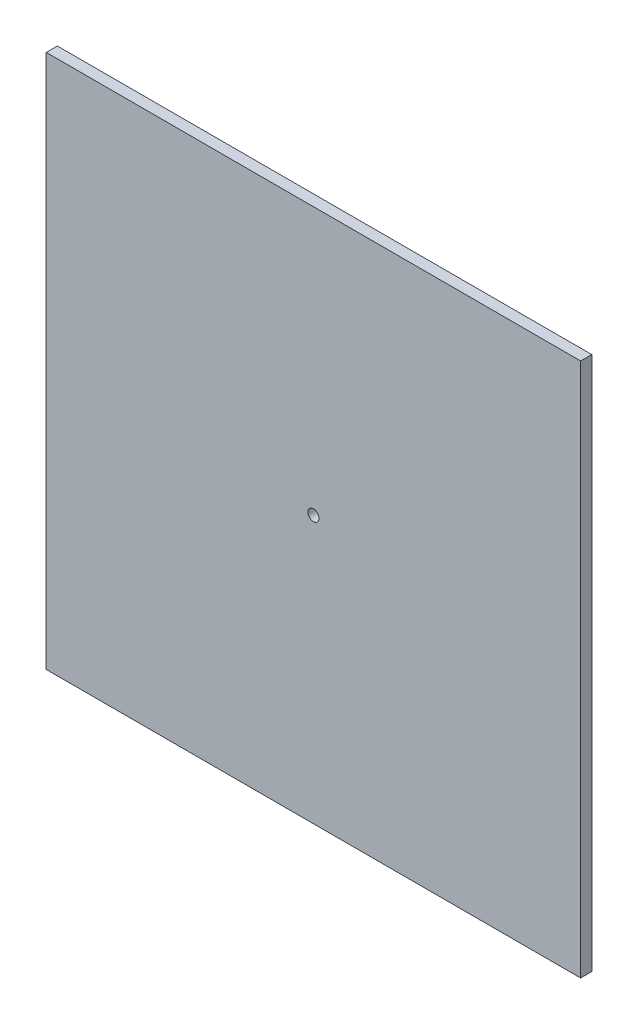
ISO-10303-21;
HEADER;
FILE_DESCRIPTION(('STEP AP214'),'2;1');
FILE_NAME('part.step','',(''),(''),'','','');
FILE_SCHEMA(('AUTOMOTIVE_DESIGN { 1 0 10303 214 1 1 1 1 }'));
ENDSEC;
DATA;
#1=APPLICATION_CONTEXT('core data for automotive mechanical design processes');
#2=APPLICATION_PROTOCOL_DEFINITION('international standard','automotive_design',2000,#1);
#3=PRODUCT_CONTEXT('',#1,'mechanical');
#4=PRODUCT('Part','Part','',(#3));
#5=PRODUCT_RELATED_PRODUCT_CATEGORY('part','',(#4));
#6=PRODUCT_DEFINITION_FORMATION('','',#4);
#7=PRODUCT_DEFINITION_CONTEXT('part definition',#1,'design');
#8=PRODUCT_DEFINITION('design','',#6,#7);
#9=PRODUCT_DEFINITION_SHAPE('','',#8);
#10=(LENGTH_UNIT() NAMED_UNIT(*) SI_UNIT(.MILLI.,.METRE.));
#11=(NAMED_UNIT(*) PLANE_ANGLE_UNIT() SI_UNIT($,.RADIAN.));
#12=(NAMED_UNIT(*) SI_UNIT($,.STERADIAN.) SOLID_ANGLE_UNIT());
#13=UNCERTAINTY_MEASURE_WITH_UNIT(LENGTH_MEASURE(1.E-05),#10,'distance_accuracy_value','');
#14=(GEOMETRIC_REPRESENTATION_CONTEXT(3) GLOBAL_UNCERTAINTY_ASSIGNED_CONTEXT((#13)) GLOBAL_UNIT_ASSIGNED_CONTEXT((#10,
#11,#12)) REPRESENTATION_CONTEXT('',''));
#15=CARTESIAN_POINT('',(0.,0.,0.));
#16=DIRECTION('',(0.,0.,1.));
#17=DIRECTION('',(1.,0.,0.));
#18=AXIS2_PLACEMENT_3D('',#15,#16,#17);
#19=CARTESIAN_POINT('',(0.,0.,6.35));
#20=DIRECTION('',(-1.,0.,0.));
#21=DIRECTION('',(0.,-1.,0.));
#22=AXIS2_PLACEMENT_3D('',#19,#20,#21);
#23=PLANE('',#22);
#24=DIRECTION('',(0.,1.,0.));
#25=VECTOR('',#24,1.);
#26=CARTESIAN_POINT('',(0.,0.,0.));
#27=LINE('',#26,#25);
#28=CARTESIAN_POINT('',(0.,0.,0.));
#29=VERTEX_POINT('',#28);
#30=CARTESIAN_POINT('',(0.,304.8,0.));
#31=VERTEX_POINT('',#30);
#32=EDGE_CURVE('E99',#29,#31,#27,.T.);
#33=ORIENTED_EDGE('',*,*,#32,.T.);
#34=DIRECTION('',(0.,0.,-1.));
#35=VECTOR('',#34,1.);
#36=CARTESIAN_POINT('',(0.,304.8,6.35));
#37=LINE('',#36,#35);
#38=CARTESIAN_POINT('',(0.,304.8,6.35));
#39=VERTEX_POINT('',#38);
#40=EDGE_CURVE('E11',#39,#31,#37,.T.);
#41=ORIENTED_EDGE('',*,*,#40,.F.);
#42=DIRECTION('',(0.,1.,0.));
#43=VECTOR('',#42,1.);
#44=CARTESIAN_POINT('',(0.,0.,6.35));
#45=LINE('',#44,#43);
#46=CARTESIAN_POINT('',(0.,0.,6.35));
#47=VERTEX_POINT('',#46);
#48=EDGE_CURVE('E87',#47,#39,#45,.T.);
#49=ORIENTED_EDGE('',*,*,#48,.F.);
#50=DIRECTION('',(0.,0.,-1.));
#51=VECTOR('',#50,1.);
#52=CARTESIAN_POINT('',(0.,0.,6.35));
#53=LINE('',#52,#51);
#54=EDGE_CURVE('E95',#47,#29,#53,.T.);
#55=ORIENTED_EDGE('',*,*,#54,.T.);
#56=EDGE_LOOP('',(#33,#41,#49,#55));
#57=FACE_BOUND('',#56,.T.);
#58=ADVANCED_FACE('F36',(#57),#23,.F.);
#59=CARTESIAN_POINT('',(0.,304.8,6.35));
#60=DIRECTION('',(0.,-1.,0.));
#61=DIRECTION('',(1.,0.,0.));
#62=AXIS2_PLACEMENT_3D('',#59,#60,#61);
#63=PLANE('',#62);
#64=DIRECTION('',(-1.,0.,0.));
#65=VECTOR('',#64,1.);
#66=CARTESIAN_POINT('',(0.,304.8,0.));
#67=LINE('',#66,#65);
#68=CARTESIAN_POINT('',(-304.8,304.8,0.));
#69=VERTEX_POINT('',#68);
#70=EDGE_CURVE('E91',#31,#69,#67,.T.);
#71=ORIENTED_EDGE('',*,*,#70,.T.);
#72=DIRECTION('',(0.,0.,-1.));
#73=VECTOR('',#72,1.);
#74=CARTESIAN_POINT('',(-304.8,304.8,6.35));
#75=LINE('',#74,#73);
#76=CARTESIAN_POINT('',(-304.8,304.8,6.35));
#77=VERTEX_POINT('',#76);
#78=EDGE_CURVE('E44',#77,#69,#75,.T.);
#79=ORIENTED_EDGE('',*,*,#78,.F.);
#80=DIRECTION('',(-1.,0.,0.));
#81=VECTOR('',#80,1.);
#82=CARTESIAN_POINT('',(0.,304.8,6.35));
#83=LINE('',#82,#81);
#84=EDGE_CURVE('E82',#39,#77,#83,.T.);
#85=ORIENTED_EDGE('',*,*,#84,.F.);
#86=ORIENTED_EDGE('',*,*,#40,.T.);
#87=EDGE_LOOP('',(#71,#79,#85,#86));
#88=FACE_BOUND('',#87,.T.);
#89=ADVANCED_FACE('F90',(#88),#63,.F.);
#90=CARTESIAN_POINT('',(-304.8,0.,6.35));
#91=DIRECTION('',(1.,0.,0.));
#92=DIRECTION('',(0.,0.,-1.));
#93=AXIS2_PLACEMENT_3D('',#90,#91,#92);
#94=PLANE('',#93);
#95=DIRECTION('',(0.,-1.,0.));
#96=VECTOR('',#95,1.);
#97=CARTESIAN_POINT('',(-304.8,0.,0.));
#98=LINE('',#97,#96);
#99=CARTESIAN_POINT('',(-304.8,0.,0.));
#100=VERTEX_POINT('',#99);
#101=EDGE_CURVE('E69',#69,#100,#98,.T.);
#102=ORIENTED_EDGE('',*,*,#101,.T.);
#103=DIRECTION('',(0.,0.,-1.));
#104=VECTOR('',#103,1.);
#105=CARTESIAN_POINT('',(-304.8,0.,6.35));
#106=LINE('',#105,#104);
#107=CARTESIAN_POINT('',(-304.8,0.,6.35));
#108=VERTEX_POINT('',#107);
#109=EDGE_CURVE('E92',#108,#100,#106,.T.);
#110=ORIENTED_EDGE('',*,*,#109,.F.);
#111=DIRECTION('',(0.,-1.,0.));
#112=VECTOR('',#111,1.);
#113=CARTESIAN_POINT('',(-304.8,0.,6.35));
#114=LINE('',#113,#112);
#115=EDGE_CURVE('E85',#77,#108,#114,.T.);
#116=ORIENTED_EDGE('',*,*,#115,.F.);
#117=ORIENTED_EDGE('',*,*,#78,.T.);
#118=EDGE_LOOP('',(#102,#110,#116,#117));
#119=FACE_BOUND('',#118,.T.);
#120=ADVANCED_FACE('F93',(#119),#94,.F.);
#121=CARTESIAN_POINT('',(0.,0.,6.35));
#122=DIRECTION('',(0.,1.,0.));
#123=DIRECTION('',(0.,0.,1.));
#124=AXIS2_PLACEMENT_3D('',#121,#122,#123);
#125=PLANE('',#124);
#126=DIRECTION('',(1.,0.,0.));
#127=VECTOR('',#126,1.);
#128=CARTESIAN_POINT('',(0.,0.,0.));
#129=LINE('',#128,#127);
#130=EDGE_CURVE('E75',#100,#29,#129,.T.);
#131=ORIENTED_EDGE('',*,*,#130,.T.);
#132=ORIENTED_EDGE('',*,*,#54,.F.);
#133=DIRECTION('',(1.,0.,0.));
#134=VECTOR('',#133,1.);
#135=CARTESIAN_POINT('',(0.,0.,6.35));
#136=LINE('',#135,#134);
#137=EDGE_CURVE('E52',#108,#47,#136,.T.);
#138=ORIENTED_EDGE('',*,*,#137,.F.);
#139=ORIENTED_EDGE('',*,*,#109,.T.);
#140=EDGE_LOOP('',(#131,#132,#138,#139));
#141=FACE_BOUND('',#140,.T.);
#142=ADVANCED_FACE('F107',(#141),#125,.F.);
#143=CARTESIAN_POINT('',(0.,0.,6.35));
#144=DIRECTION('',(0.,0.,1.));
#145=DIRECTION('',(1.,0.,0.));
#146=AXIS2_PLACEMENT_3D('',#143,#144,#145);
#147=PLANE('',#146);
#148=CARTESIAN_POINT('',(-152.4,152.4,6.35));
#149=DIRECTION('',(0.,0.,1.));
#150=DIRECTION('',(1.,0.,0.));
#151=AXIS2_PLACEMENT_3D('',#148,#149,#150);
#152=CIRCLE('',#151,3.17500000000001);
#153=CARTESIAN_POINT('',(-149.225,152.4,6.35));
#154=VERTEX_POINT('',#153);
#155=EDGE_CURVE('E113',#154,#154,#152,.T.);
#156=ORIENTED_EDGE('',*,*,#155,.F.);
#157=EDGE_LOOP('',(#156));
#158=FACE_BOUND('',#157,.T.);
#159=ORIENTED_EDGE('',*,*,#48,.T.);
#160=ORIENTED_EDGE('',*,*,#84,.T.);
#161=ORIENTED_EDGE('',*,*,#115,.T.);
#162=ORIENTED_EDGE('',*,*,#137,.T.);
#163=EDGE_LOOP('',(#159,#160,#161,#162));
#164=FACE_BOUND('',#163,.T.);
#165=ADVANCED_FACE('F83',(#158,#164),#147,.T.);
#166=CARTESIAN_POINT('',(0.,0.,0.));
#167=DIRECTION('',(0.,0.,1.));
#168=DIRECTION('',(1.,0.,0.));
#169=AXIS2_PLACEMENT_3D('',#166,#167,#168);
#170=PLANE('',#169);
#171=CARTESIAN_POINT('',(-152.4,152.4,0.));
#172=DIRECTION('',(0.,0.,1.));
#173=DIRECTION('',(1.,0.,0.));
#174=AXIS2_PLACEMENT_3D('',#171,#172,#173);
#175=CIRCLE('',#174,3.17500000000001);
#176=CARTESIAN_POINT('',(-149.225,152.4,0.));
#177=VERTEX_POINT('',#176);
#178=EDGE_CURVE('E102',#177,#177,#175,.F.);
#179=ORIENTED_EDGE('',*,*,#178,.F.);
#180=EDGE_LOOP('',(#179));
#181=FACE_BOUND('',#180,.T.);
#182=ORIENTED_EDGE('',*,*,#32,.F.);
#183=ORIENTED_EDGE('',*,*,#130,.F.);
#184=ORIENTED_EDGE('',*,*,#101,.F.);
#185=ORIENTED_EDGE('',*,*,#70,.F.);
#186=EDGE_LOOP('',(#182,#183,#184,#185));
#187=FACE_BOUND('',#186,.T.);
#188=ADVANCED_FACE('F110',(#181,#187),#170,.F.);
#189=CARTESIAN_POINT('',(-152.4,152.4,6.35));
#190=DIRECTION('',(0.,0.,1.));
#191=DIRECTION('',(1.,0.,0.));
#192=AXIS2_PLACEMENT_3D('',#189,#190,#191);
#193=CYLINDRICAL_SURFACE('',#192,3.17500000000001);
#194=ORIENTED_EDGE('',*,*,#178,.T.);
#195=EDGE_LOOP('',(#194));
#196=FACE_BOUND('',#195,.T.);
#197=ORIENTED_EDGE('',*,*,#155,.T.);
#198=EDGE_LOOP('',(#197));
#199=FACE_BOUND('',#198,.T.);
#200=ADVANCED_FACE('F119',(#196,#199),#193,.F.);
#201=CLOSED_SHELL('',(#58,#89,#120,#142,#165,#188,#200));
#202=MANIFOLD_SOLID_BREP('B2',#201);
#203=ADVANCED_BREP_SHAPE_REPRESENTATION('',(#18,#202),#14);
#204=SHAPE_DEFINITION_REPRESENTATION(#9,#203);
ENDSEC;
END-ISO-10303-21;
